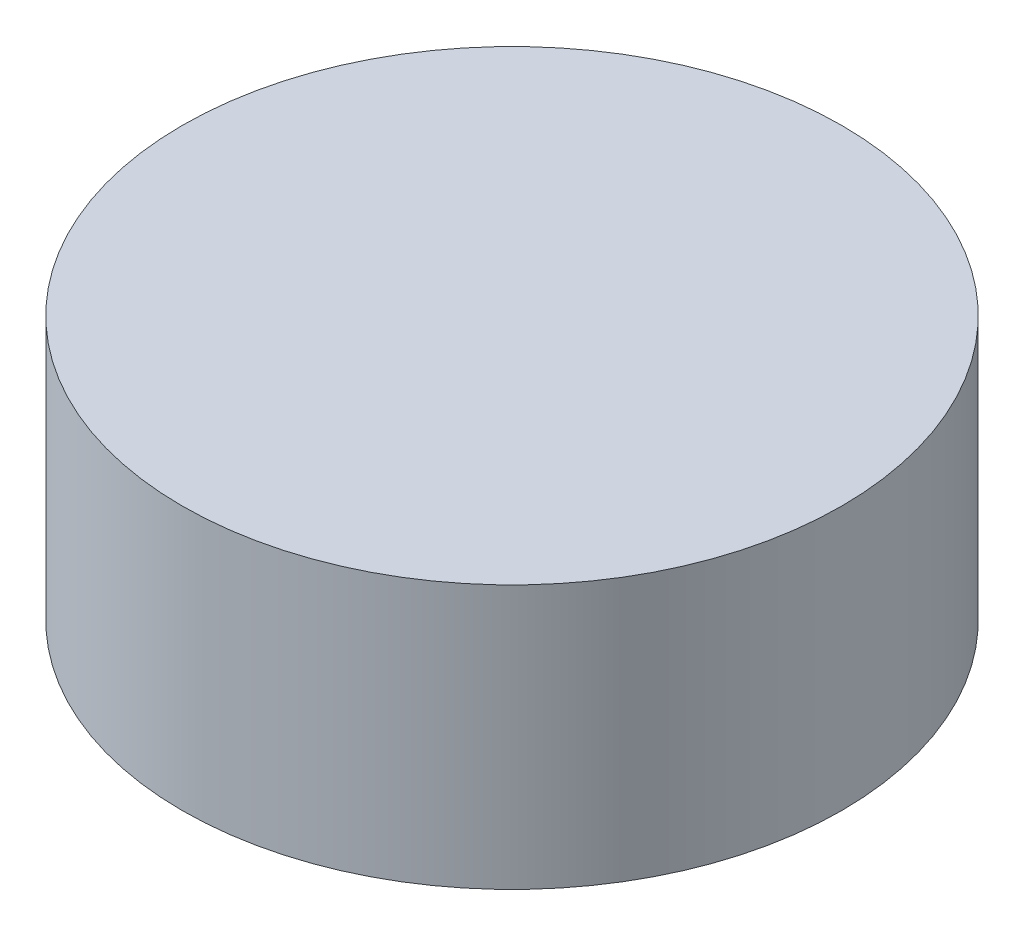
ISO-10303-21;
HEADER;
FILE_DESCRIPTION(('STEP AP214'),'2;1');
FILE_NAME('part.step','',(''),(''),'','','');
FILE_SCHEMA(('AUTOMOTIVE_DESIGN { 1 0 10303 214 1 1 1 1 }'));
ENDSEC;
DATA;
#1=APPLICATION_CONTEXT('core data for automotive mechanical design processes');
#2=APPLICATION_PROTOCOL_DEFINITION('international standard','automotive_design',2000,#1);
#3=PRODUCT_CONTEXT('',#1,'mechanical');
#4=PRODUCT('Part','Part','',(#3));
#5=PRODUCT_RELATED_PRODUCT_CATEGORY('part','',(#4));
#6=PRODUCT_DEFINITION_FORMATION('','',#4);
#7=PRODUCT_DEFINITION_CONTEXT('part definition',#1,'design');
#8=PRODUCT_DEFINITION('design','',#6,#7);
#9=PRODUCT_DEFINITION_SHAPE('','',#8);
#10=(LENGTH_UNIT() NAMED_UNIT(*) SI_UNIT(.MILLI.,.METRE.));
#11=(NAMED_UNIT(*) PLANE_ANGLE_UNIT() SI_UNIT($,.RADIAN.));
#12=(NAMED_UNIT(*) SI_UNIT($,.STERADIAN.) SOLID_ANGLE_UNIT());
#13=UNCERTAINTY_MEASURE_WITH_UNIT(LENGTH_MEASURE(1.E-05),#10,'distance_accuracy_value','');
#14=(GEOMETRIC_REPRESENTATION_CONTEXT(3) GLOBAL_UNCERTAINTY_ASSIGNED_CONTEXT((#13)) GLOBAL_UNIT_ASSIGNED_CONTEXT((#10,
#11,#12)) REPRESENTATION_CONTEXT('',''));
#15=CARTESIAN_POINT('',(0.,0.,0.));
#16=DIRECTION('',(0.,0.,1.));
#17=DIRECTION('',(1.,0.,0.));
#18=AXIS2_PLACEMENT_3D('',#15,#16,#17);
#19=CARTESIAN_POINT('',(0.,0.,0.));
#20=DIRECTION('',(0.,-1.,0.));
#21=DIRECTION('',(0.,0.,-1.));
#22=AXIS2_PLACEMENT_3D('',#19,#20,#21);
#23=PLANE('',#22);
#24=CARTESIAN_POINT('',(0.,0.,0.));
#25=DIRECTION('',(0.,-1.,0.));
#26=DIRECTION('',(0.,0.,-1.));
#27=AXIS2_PLACEMENT_3D('',#24,#25,#26);
#28=CIRCLE('',#27,25.);
#29=CARTESIAN_POINT('',(0.,0.,-25.));
#30=VERTEX_POINT('',#29);
#31=EDGE_CURVE('E10',#30,#30,#28,.T.);
#32=ORIENTED_EDGE('',*,*,#31,.T.);
#33=EDGE_LOOP('',(#32));
#34=FACE_BOUND('',#33,.T.);
#35=ADVANCED_FACE('F372',(#34),#23,.T.);
#36=CARTESIAN_POINT('',(0.,0.,0.));
#37=DIRECTION('',(0.,-1.,0.));
#38=DIRECTION('',(0.,0.,-1.));
#39=AXIS2_PLACEMENT_3D('',#36,#37,#38);
#40=CYLINDRICAL_SURFACE('',#39,25.);
#41=CARTESIAN_POINT('',(0.,20.,0.));
#42=DIRECTION('',(0.,-1.,0.));
#43=DIRECTION('',(0.,0.,-1.));
#44=AXIS2_PLACEMENT_3D('',#41,#42,#43);
#45=CIRCLE('',#44,25.);
#46=CARTESIAN_POINT('',(0.,20.,-25.));
#47=VERTEX_POINT('',#46);
#48=EDGE_CURVE('E378',#47,#47,#45,.T.);
#49=ORIENTED_EDGE('',*,*,#48,.T.);
#50=EDGE_LOOP('',(#49));
#51=FACE_BOUND('',#50,.T.);
#52=ORIENTED_EDGE('',*,*,#31,.F.);
#53=EDGE_LOOP('',(#52));
#54=FACE_BOUND('',#53,.T.);
#55=ADVANCED_FACE('F384',(#51,#54),#40,.T.);
#56=CARTESIAN_POINT('',(25.,20.,0.));
#57=DIRECTION('',(0.,1.,0.));
#58=DIRECTION('',(0.,0.,1.));
#59=AXIS2_PLACEMENT_3D('',#56,#57,#58);
#60=PLANE('',#59);
#61=ORIENTED_EDGE('',*,*,#48,.F.);
#62=EDGE_LOOP('',(#61));
#63=FACE_BOUND('',#62,.T.);
#64=ADVANCED_FACE('F387',(#63),#60,.T.);
#65=CLOSED_SHELL('',(#35,#55,#64));
#66=MANIFOLD_SOLID_BREP('B2',#65);
#67=ADVANCED_BREP_SHAPE_REPRESENTATION('',(#18,#66),#14);
#68=SHAPE_DEFINITION_REPRESENTATION(#9,#67);
ENDSEC;
END-ISO-10303-21;
